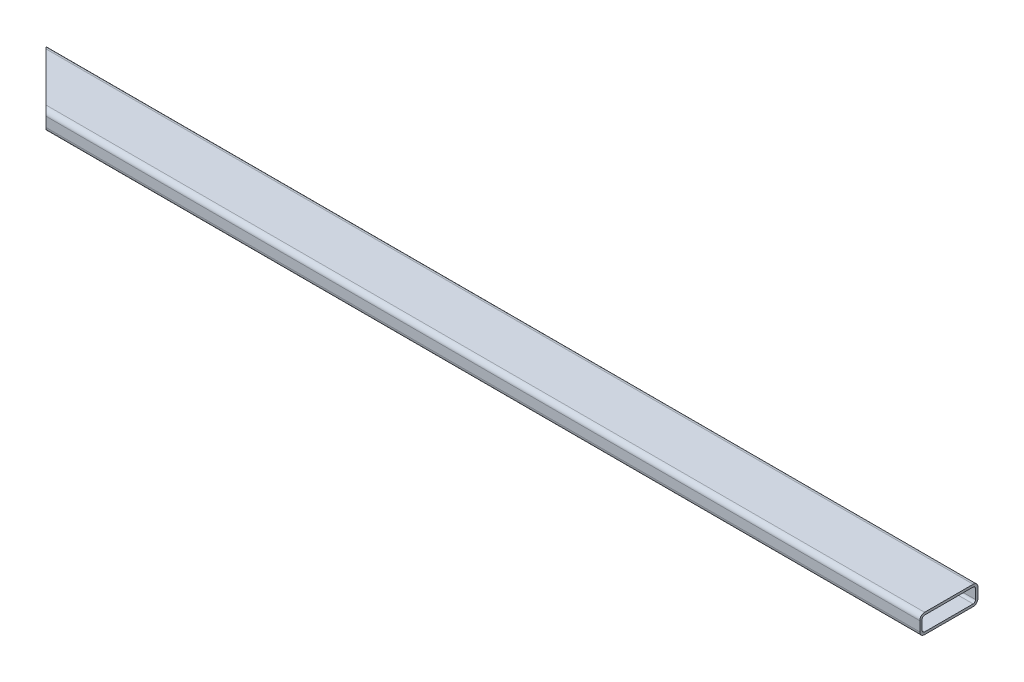
ISO-10303-21;
HEADER;
FILE_DESCRIPTION(('STEP AP214'),'2;1');
FILE_NAME('part.step','',(''),(''),'','','');
FILE_SCHEMA(('AUTOMOTIVE_DESIGN { 1 0 10303 214 1 1 1 1 }'));
ENDSEC;
DATA;
#1=APPLICATION_CONTEXT('core data for automotive mechanical design processes');
#2=APPLICATION_PROTOCOL_DEFINITION('international standard','automotive_design',2000,#1);
#3=PRODUCT_CONTEXT('',#1,'mechanical');
#4=PRODUCT('Part','Part','',(#3));
#5=PRODUCT_RELATED_PRODUCT_CATEGORY('part','',(#4));
#6=PRODUCT_DEFINITION_FORMATION('','',#4);
#7=PRODUCT_DEFINITION_CONTEXT('part definition',#1,'design');
#8=PRODUCT_DEFINITION('design','',#6,#7);
#9=PRODUCT_DEFINITION_SHAPE('','',#8);
#10=(LENGTH_UNIT() NAMED_UNIT(*) SI_UNIT(.MILLI.,.METRE.));
#11=(NAMED_UNIT(*) PLANE_ANGLE_UNIT() SI_UNIT($,.RADIAN.));
#12=(NAMED_UNIT(*) SI_UNIT($,.STERADIAN.) SOLID_ANGLE_UNIT());
#13=UNCERTAINTY_MEASURE_WITH_UNIT(LENGTH_MEASURE(1.E-05),#10,'distance_accuracy_value','');
#14=(GEOMETRIC_REPRESENTATION_CONTEXT(3) GLOBAL_UNCERTAINTY_ASSIGNED_CONTEXT((#13)) GLOBAL_UNIT_ASSIGNED_CONTEXT((#10,
#11,#12)) REPRESENTATION_CONTEXT('',''));
#15=CARTESIAN_POINT('',(0.,0.,0.));
#16=DIRECTION('',(0.,0.,1.));
#17=DIRECTION('',(1.,0.,0.));
#18=AXIS2_PLACEMENT_3D('',#15,#16,#17);
#19=CARTESIAN_POINT('',(1219.2,0.,0.));
#20=DIRECTION('',(0.,0.,-1.));
#21=DIRECTION('',(-1.,0.,0.));
#22=AXIS2_PLACEMENT_3D('',#19,#20,#21);
#23=PLANE('',#22);
#24=DIRECTION('',(-1.,0.,0.));
#25=VECTOR('',#24,1.);
#26=CARTESIAN_POINT('',(1219.2,19.05,0.));
#27=LINE('',#26,#25);
#28=CARTESIAN_POINT('',(1219.2,19.05,0.));
#29=VERTEX_POINT('',#28);
#30=CARTESIAN_POINT('',(76.1999999999998,19.05,0.));
#31=VERTEX_POINT('',#30);
#32=EDGE_CURVE('E171',#29,#31,#27,.T.);
#33=ORIENTED_EDGE('',*,*,#32,.T.);
#34=DIRECTION('',(0.,1.,0.));
#35=VECTOR('',#34,1.);
#36=CARTESIAN_POINT('',(76.1999999999998,0.,0.));
#37=LINE('',#36,#35);
#38=CARTESIAN_POINT('',(76.1999999999998,6.35,0.));
#39=VERTEX_POINT('',#38);
#40=EDGE_CURVE('E51',#39,#31,#37,.T.);
#41=ORIENTED_EDGE('',*,*,#40,.F.);
#42=DIRECTION('',(-1.,0.,0.));
#43=VECTOR('',#42,1.);
#44=CARTESIAN_POINT('',(1219.2,6.35,0.));
#45=LINE('',#44,#43);
#46=CARTESIAN_POINT('',(1219.2,6.35,0.));
#47=VERTEX_POINT('',#46);
#48=EDGE_CURVE('E44',#39,#47,#45,.F.);
#49=ORIENTED_EDGE('',*,*,#48,.T.);
#50=DIRECTION('',(0.,-1.,0.));
#51=VECTOR('',#50,1.);
#52=CARTESIAN_POINT('',(1219.2,0.,0.));
#53=LINE('',#52,#51);
#54=EDGE_CURVE('E181',#29,#47,#53,.T.);
#55=ORIENTED_EDGE('',*,*,#54,.F.);
#56=EDGE_LOOP('',(#33,#41,#49,#55));
#57=FACE_BOUND('',#56,.T.);
#58=ADVANCED_FACE('F36',(#57),#23,.F.);
#59=CARTESIAN_POINT('',(1219.2,0.,0.));
#60=DIRECTION('',(0.,1.,0.));
#61=DIRECTION('',(0.,0.,1.));
#62=AXIS2_PLACEMENT_3D('',#59,#60,#61);
#63=PLANE('',#62);
#64=DIRECTION('',(-1.,0.,0.));
#65=VECTOR('',#64,1.);
#66=CARTESIAN_POINT('',(1219.2,0.,-6.35));
#67=LINE('',#66,#65);
#68=CARTESIAN_POINT('',(1219.2,0.,-6.35));
#69=VERTEX_POINT('',#68);
#70=CARTESIAN_POINT('',(69.8499999999999,0.,-6.34999999999998));
#71=VERTEX_POINT('',#70);
#72=EDGE_CURVE('E196',#69,#71,#67,.T.);
#73=ORIENTED_EDGE('',*,*,#72,.T.);
#74=DIRECTION('',(-0.707106781186547,0.,-0.707106781186548));
#75=VECTOR('',#74,1.);
#76=CARTESIAN_POINT('',(0.,0.,-76.2));
#77=LINE('',#76,#75);
#78=CARTESIAN_POINT('',(6.35000000000005,0.,-69.85));
#79=VERTEX_POINT('',#78);
#80=EDGE_CURVE('E165',#71,#79,#77,.T.);
#81=ORIENTED_EDGE('',*,*,#80,.T.);
#82=DIRECTION('',(-1.,0.,0.));
#83=VECTOR('',#82,1.);
#84=CARTESIAN_POINT('',(1219.2,0.,-69.85));
#85=LINE('',#84,#83);
#86=CARTESIAN_POINT('',(1219.2,0.,-69.85));
#87=VERTEX_POINT('',#86);
#88=EDGE_CURVE('E198',#79,#87,#85,.F.);
#89=ORIENTED_EDGE('',*,*,#88,.T.);
#90=DIRECTION('',(0.,0.,-1.));
#91=VECTOR('',#90,1.);
#92=CARTESIAN_POINT('',(1219.2,0.,0.));
#93=LINE('',#92,#91);
#94=EDGE_CURVE('E190',#69,#87,#93,.T.);
#95=ORIENTED_EDGE('',*,*,#94,.F.);
#96=EDGE_LOOP('',(#73,#81,#89,#95));
#97=FACE_BOUND('',#96,.T.);
#98=ADVANCED_FACE('F280',(#97),#63,.F.);
#99=CARTESIAN_POINT('',(1219.2,0.,-76.2));
#100=DIRECTION('',(0.,0.,1.));
#101=DIRECTION('',(1.,0.,0.));
#102=AXIS2_PLACEMENT_3D('',#99,#100,#101);
#103=PLANE('',#102);
#104=DIRECTION('',(0.,1.,0.));
#105=VECTOR('',#104,1.);
#106=CARTESIAN_POINT('',(1219.2,0.,-76.2));
#107=LINE('',#106,#105);
#108=CARTESIAN_POINT('',(1219.2,6.35,-76.2));
#109=VERTEX_POINT('',#108);
#110=CARTESIAN_POINT('',(1219.2,19.05,-76.2));
#111=VERTEX_POINT('',#110);
#112=EDGE_CURVE('E213',#109,#111,#107,.T.);
#113=ORIENTED_EDGE('',*,*,#112,.F.);
#114=DIRECTION('',(-1.,0.,0.));
#115=VECTOR('',#114,1.);
#116=CARTESIAN_POINT('',(1219.2,6.35,-76.2));
#117=LINE('',#116,#115);
#118=CARTESIAN_POINT('',(0.,6.35,-76.2));
#119=VERTEX_POINT('',#118);
#120=EDGE_CURVE('E203',#109,#119,#117,.T.);
#121=ORIENTED_EDGE('',*,*,#120,.T.);
#122=DIRECTION('',(0.,1.,0.));
#123=VECTOR('',#122,1.);
#124=CARTESIAN_POINT('',(0.,0.,-76.2));
#125=LINE('',#124,#123);
#126=CARTESIAN_POINT('',(0.,19.05,-76.2));
#127=VERTEX_POINT('',#126);
#128=EDGE_CURVE('E191',#119,#127,#125,.T.);
#129=ORIENTED_EDGE('',*,*,#128,.T.);
#130=DIRECTION('',(-1.,0.,0.));
#131=VECTOR('',#130,1.);
#132=CARTESIAN_POINT('',(1219.2,19.05,-76.2));
#133=LINE('',#132,#131);
#134=EDGE_CURVE('E206',#127,#111,#133,.F.);
#135=ORIENTED_EDGE('',*,*,#134,.T.);
#136=EDGE_LOOP('',(#113,#121,#129,#135));
#137=FACE_BOUND('',#136,.T.);
#138=ADVANCED_FACE('F289',(#137),#103,.F.);
#139=CARTESIAN_POINT('',(1219.2,25.4,0.));
#140=DIRECTION('',(0.,-1.,0.));
#141=DIRECTION('',(0.,0.,-1.));
#142=AXIS2_PLACEMENT_3D('',#139,#140,#141);
#143=PLANE('',#142);
#144=DIRECTION('',(-1.,0.,0.));
#145=VECTOR('',#144,1.);
#146=CARTESIAN_POINT('',(1219.2,25.4,-69.85));
#147=LINE('',#146,#145);
#148=CARTESIAN_POINT('',(1219.2,25.4,-69.85));
#149=VERTEX_POINT('',#148);
#150=CARTESIAN_POINT('',(6.35000000000005,25.4,-69.85));
#151=VERTEX_POINT('',#150);
#152=EDGE_CURVE('E164',#149,#151,#147,.T.);
#153=ORIENTED_EDGE('',*,*,#152,.T.);
#154=DIRECTION('',(-0.707106781186547,0.,-0.707106781186548));
#155=VECTOR('',#154,1.);
#156=CARTESIAN_POINT('',(0.,25.4,-76.2));
#157=LINE('',#156,#155);
#158=CARTESIAN_POINT('',(69.8499999999999,25.4,-6.34999999999998));
#159=VERTEX_POINT('',#158);
#160=EDGE_CURVE('E148',#159,#151,#157,.T.);
#161=ORIENTED_EDGE('',*,*,#160,.F.);
#162=DIRECTION('',(-1.,0.,0.));
#163=VECTOR('',#162,1.);
#164=CARTESIAN_POINT('',(1219.2,25.4,-6.35));
#165=LINE('',#164,#163);
#166=CARTESIAN_POINT('',(1219.2,25.4,-6.35));
#167=VERTEX_POINT('',#166);
#168=EDGE_CURVE('E161',#159,#167,#165,.F.);
#169=ORIENTED_EDGE('',*,*,#168,.T.);
#170=DIRECTION('',(0.,0.,1.));
#171=VECTOR('',#170,1.);
#172=CARTESIAN_POINT('',(1219.2,25.4,0.));
#173=LINE('',#172,#171);
#174=EDGE_CURVE('E208',#149,#167,#173,.T.);
#175=ORIENTED_EDGE('',*,*,#174,.F.);
#176=EDGE_LOOP('',(#153,#161,#169,#175));
#177=FACE_BOUND('',#176,.T.);
#178=ADVANCED_FACE('F159',(#177),#143,.F.);
#179=CARTESIAN_POINT('',(1219.2,0.,0.));
#180=DIRECTION('',(-1.,0.,0.));
#181=DIRECTION('',(0.,0.,1.));
#182=AXIS2_PLACEMENT_3D('',#179,#180,#181);
#183=PLANE('',#182);
#184=DIRECTION('',(0.,0.,-1.));
#185=VECTOR('',#184,1.);
#186=CARTESIAN_POINT('',(1219.2,3.175,0.));
#187=LINE('',#186,#185);
#188=CARTESIAN_POINT('',(1219.2,3.175,-6.35));
#189=VERTEX_POINT('',#188);
#190=CARTESIAN_POINT('',(1219.2,3.175,-69.85));
#191=VERTEX_POINT('',#190);
#192=EDGE_CURVE('E231',#189,#191,#187,.T.);
#193=ORIENTED_EDGE('',*,*,#192,.F.);
#194=CARTESIAN_POINT('',(1219.2,6.35,-6.35));
#195=DIRECTION('',(-1.,0.,0.));
#196=DIRECTION('',(0.,0.,1.));
#197=AXIS2_PLACEMENT_3D('',#194,#195,#196);
#198=CIRCLE('',#197,3.175);
#199=CARTESIAN_POINT('',(1219.2,6.35,-3.175));
#200=VERTEX_POINT('',#199);
#201=EDGE_CURVE('E219',#200,#189,#198,.F.);
#202=ORIENTED_EDGE('',*,*,#201,.F.);
#203=DIRECTION('',(0.,-1.,0.));
#204=VECTOR('',#203,1.);
#205=CARTESIAN_POINT('',(1219.2,0.,-3.175));
#206=LINE('',#205,#204);
#207=CARTESIAN_POINT('',(1219.2,19.05,-3.175));
#208=VERTEX_POINT('',#207);
#209=EDGE_CURVE('E236',#208,#200,#206,.T.);
#210=ORIENTED_EDGE('',*,*,#209,.F.);
#211=CARTESIAN_POINT('',(1219.2,19.05,-6.35));
#212=DIRECTION('',(-1.,0.,0.));
#213=DIRECTION('',(0.,0.,1.));
#214=AXIS2_PLACEMENT_3D('',#211,#212,#213);
#215=CIRCLE('',#214,3.175);
#216=CARTESIAN_POINT('',(1219.2,22.225,-6.35));
#217=VERTEX_POINT('',#216);
#218=EDGE_CURVE('E217',#217,#208,#215,.F.);
#219=ORIENTED_EDGE('',*,*,#218,.F.);
#220=DIRECTION('',(0.,0.,1.));
#221=VECTOR('',#220,1.);
#222=CARTESIAN_POINT('',(1219.2,22.225,0.));
#223=LINE('',#222,#221);
#224=CARTESIAN_POINT('',(1219.2,22.225,-69.85));
#225=VERTEX_POINT('',#224);
#226=EDGE_CURVE('E221',#225,#217,#223,.T.);
#227=ORIENTED_EDGE('',*,*,#226,.F.);
#228=CARTESIAN_POINT('',(1219.2,19.05,-69.85));
#229=DIRECTION('',(-1.,0.,0.));
#230=DIRECTION('',(0.,0.,1.));
#231=AXIS2_PLACEMENT_3D('',#228,#229,#230);
#232=CIRCLE('',#231,3.175);
#233=CARTESIAN_POINT('',(1219.2,19.05,-73.025));
#234=VERTEX_POINT('',#233);
#235=EDGE_CURVE('E226',#234,#225,#232,.F.);
#236=ORIENTED_EDGE('',*,*,#235,.F.);
#237=DIRECTION('',(0.,1.,0.));
#238=VECTOR('',#237,1.);
#239=CARTESIAN_POINT('',(1219.2,0.,-73.025));
#240=LINE('',#239,#238);
#241=CARTESIAN_POINT('',(1219.2,6.35,-73.025));
#242=VERTEX_POINT('',#241);
#243=EDGE_CURVE('E225',#242,#234,#240,.T.);
#244=ORIENTED_EDGE('',*,*,#243,.F.);
#245=CARTESIAN_POINT('',(1219.2,6.35,-69.85));
#246=DIRECTION('',(-1.,0.,0.));
#247=DIRECTION('',(0.,0.,1.));
#248=AXIS2_PLACEMENT_3D('',#245,#246,#247);
#249=CIRCLE('',#248,3.175);
#250=EDGE_CURVE('E228',#191,#242,#249,.F.);
#251=ORIENTED_EDGE('',*,*,#250,.F.);
#252=EDGE_LOOP('',(#193,#202,#210,#219,#227,#236,#244,#251));
#253=FACE_BOUND('',#252,.T.);
#254=ORIENTED_EDGE('',*,*,#94,.T.);
#255=CARTESIAN_POINT('',(1219.2,6.35,-69.85));
#256=DIRECTION('',(-1.,0.,0.));
#257=DIRECTION('',(0.,0.,1.));
#258=AXIS2_PLACEMENT_3D('',#255,#256,#257);
#259=CIRCLE('',#258,6.35);
#260=EDGE_CURVE('E169',#87,#109,#259,.F.);
#261=ORIENTED_EDGE('',*,*,#260,.T.);
#262=ORIENTED_EDGE('',*,*,#112,.T.);
#263=CARTESIAN_POINT('',(1219.2,19.05,-69.85));
#264=DIRECTION('',(-1.,0.,0.));
#265=DIRECTION('',(0.,0.,1.));
#266=AXIS2_PLACEMENT_3D('',#263,#264,#265);
#267=CIRCLE('',#266,6.35);
#268=EDGE_CURVE('E173',#111,#149,#267,.F.);
#269=ORIENTED_EDGE('',*,*,#268,.T.);
#270=ORIENTED_EDGE('',*,*,#174,.T.);
#271=CARTESIAN_POINT('',(1219.2,19.05,-6.35));
#272=DIRECTION('',(-1.,0.,0.));
#273=DIRECTION('',(0.,0.,1.));
#274=AXIS2_PLACEMENT_3D('',#271,#272,#273);
#275=CIRCLE('',#274,6.35);
#276=EDGE_CURVE('E168',#167,#29,#275,.F.);
#277=ORIENTED_EDGE('',*,*,#276,.T.);
#278=ORIENTED_EDGE('',*,*,#54,.T.);
#279=CARTESIAN_POINT('',(1219.2,6.35,-6.35));
#280=DIRECTION('',(-1.,0.,0.));
#281=DIRECTION('',(0.,0.,1.));
#282=AXIS2_PLACEMENT_3D('',#279,#280,#281);
#283=CIRCLE('',#282,6.35);
#284=EDGE_CURVE('E188',#47,#69,#283,.F.);
#285=ORIENTED_EDGE('',*,*,#284,.T.);
#286=EDGE_LOOP('',(#254,#261,#262,#269,#270,#277,#278,#285));
#287=FACE_BOUND('',#286,.T.);
#288=ADVANCED_FACE('F187',(#253,#287),#183,.F.);
#289=CARTESIAN_POINT('',(1219.2,6.35,-69.85));
#290=DIRECTION('',(-1.,0.,0.));
#291=DIRECTION('',(0.,0.,1.));
#292=AXIS2_PLACEMENT_3D('',#289,#290,#291);
#293=CYLINDRICAL_SURFACE('',#292,6.35);
#294=CARTESIAN_POINT('',(6.35000000000008,6.35,-69.85));
#295=DIRECTION('',(0.707106781186548,0.,-0.707106781186547));
#296=DIRECTION('',(-0.707106781186547,0.,-0.707106781186548));
#297=AXIS2_PLACEMENT_3D('',#294,#295,#296);
#298=ELLIPSE('',#297,8.98025612106914,6.35);
#299=EDGE_CURVE('E240',#119,#79,#298,.F.);
#300=ORIENTED_EDGE('',*,*,#299,.F.);
#301=ORIENTED_EDGE('',*,*,#120,.F.);
#302=ORIENTED_EDGE('',*,*,#260,.F.);
#303=ORIENTED_EDGE('',*,*,#88,.F.);
#304=EDGE_LOOP('',(#300,#301,#302,#303));
#305=FACE_BOUND('',#304,.T.);
#306=ADVANCED_FACE('F284',(#305),#293,.T.);
#307=CARTESIAN_POINT('',(1219.2,19.05,-69.85));
#308=DIRECTION('',(-1.,0.,0.));
#309=DIRECTION('',(0.,0.,1.));
#310=AXIS2_PLACEMENT_3D('',#307,#308,#309);
#311=CYLINDRICAL_SURFACE('',#310,6.35);
#312=CARTESIAN_POINT('',(6.35000000000008,19.05,-69.85));
#313=DIRECTION('',(0.707106781186548,0.,-0.707106781186547));
#314=DIRECTION('',(-0.707106781186547,0.,-0.707106781186548));
#315=AXIS2_PLACEMENT_3D('',#312,#313,#314);
#316=ELLIPSE('',#315,8.98025612106914,6.35);
#317=EDGE_CURVE('E258',#151,#127,#316,.F.);
#318=ORIENTED_EDGE('',*,*,#317,.F.);
#319=ORIENTED_EDGE('',*,*,#152,.F.);
#320=ORIENTED_EDGE('',*,*,#268,.F.);
#321=ORIENTED_EDGE('',*,*,#134,.F.);
#322=EDGE_LOOP('',(#318,#319,#320,#321));
#323=FACE_BOUND('',#322,.T.);
#324=ADVANCED_FACE('F292',(#323),#311,.T.);
#325=CARTESIAN_POINT('',(1219.2,6.35,-6.35));
#326=DIRECTION('',(-1.,0.,0.));
#327=DIRECTION('',(0.,0.,1.));
#328=AXIS2_PLACEMENT_3D('',#325,#326,#327);
#329=CYLINDRICAL_SURFACE('',#328,6.35);
#330=CARTESIAN_POINT('',(69.85,6.35,-6.35));
#331=DIRECTION('',(0.707106781186548,0.,-0.707106781186547));
#332=DIRECTION('',(-0.707106781186547,0.,-0.707106781186548));
#333=AXIS2_PLACEMENT_3D('',#330,#331,#332);
#334=ELLIPSE('',#333,8.98025612106914,6.35);
#335=EDGE_CURVE('E154',#71,#39,#334,.F.);
#336=ORIENTED_EDGE('',*,*,#335,.F.);
#337=ORIENTED_EDGE('',*,*,#72,.F.);
#338=ORIENTED_EDGE('',*,*,#284,.F.);
#339=ORIENTED_EDGE('',*,*,#48,.F.);
#340=EDGE_LOOP('',(#336,#337,#338,#339));
#341=FACE_BOUND('',#340,.T.);
#342=ADVANCED_FACE('F194',(#341),#329,.T.);
#343=CARTESIAN_POINT('',(1219.2,19.05,-6.35));
#344=DIRECTION('',(-1.,0.,0.));
#345=DIRECTION('',(0.,0.,1.));
#346=AXIS2_PLACEMENT_3D('',#343,#344,#345);
#347=CYLINDRICAL_SURFACE('',#346,6.35);
#348=CARTESIAN_POINT('',(69.85,19.05,-6.35));
#349=DIRECTION('',(0.707106781186548,0.,-0.707106781186547));
#350=DIRECTION('',(-0.707106781186547,0.,-0.707106781186548));
#351=AXIS2_PLACEMENT_3D('',#348,#349,#350);
#352=ELLIPSE('',#351,8.98025612106914,6.35);
#353=EDGE_CURVE('E145',#31,#159,#352,.F.);
#354=ORIENTED_EDGE('',*,*,#353,.F.);
#355=ORIENTED_EDGE('',*,*,#32,.F.);
#356=ORIENTED_EDGE('',*,*,#276,.F.);
#357=ORIENTED_EDGE('',*,*,#168,.F.);
#358=EDGE_LOOP('',(#354,#355,#356,#357));
#359=FACE_BOUND('',#358,.T.);
#360=ADVANCED_FACE('F38',(#359),#347,.T.);
#361=CARTESIAN_POINT('',(1219.2,0.,-3.175));
#362=DIRECTION('',(0.,0.,-1.));
#363=DIRECTION('',(-1.,0.,0.));
#364=AXIS2_PLACEMENT_3D('',#361,#362,#363);
#365=PLANE('',#364);
#366=DIRECTION('',(0.,-1.,0.));
#367=VECTOR('',#366,1.);
#368=CARTESIAN_POINT('',(73.0249999999999,0.,-3.175));
#369=LINE('',#368,#367);
#370=CARTESIAN_POINT('',(73.0249999999999,19.05,-3.175));
#371=VERTEX_POINT('',#370);
#372=CARTESIAN_POINT('',(73.0249999999999,6.35,-3.175));
#373=VERTEX_POINT('',#372);
#374=EDGE_CURVE('E273',#371,#373,#369,.T.);
#375=ORIENTED_EDGE('',*,*,#374,.F.);
#376=DIRECTION('',(-1.,0.,0.));
#377=VECTOR('',#376,1.);
#378=CARTESIAN_POINT('',(1219.2,19.05,-3.175));
#379=LINE('',#378,#377);
#380=EDGE_CURVE('E245',#208,#371,#379,.T.);
#381=ORIENTED_EDGE('',*,*,#380,.F.);
#382=ORIENTED_EDGE('',*,*,#209,.T.);
#383=DIRECTION('',(-1.,0.,0.));
#384=VECTOR('',#383,1.);
#385=CARTESIAN_POINT('',(1219.2,6.35,-3.175));
#386=LINE('',#385,#384);
#387=EDGE_CURVE('E211',#373,#200,#386,.F.);
#388=ORIENTED_EDGE('',*,*,#387,.F.);
#389=EDGE_LOOP('',(#375,#381,#382,#388));
#390=FACE_BOUND('',#389,.T.);
#391=ADVANCED_FACE('F341',(#390),#365,.T.);
#392=CARTESIAN_POINT('',(1219.2,3.175,0.));
#393=DIRECTION('',(0.,1.,0.));
#394=DIRECTION('',(0.,0.,1.));
#395=AXIS2_PLACEMENT_3D('',#392,#393,#394);
#396=PLANE('',#395);
#397=DIRECTION('',(-0.707106781186547,0.,-0.707106781186548));
#398=VECTOR('',#397,1.);
#399=CARTESIAN_POINT('',(647.699999999998,3.175,571.5));
#400=LINE('',#399,#398);
#401=CARTESIAN_POINT('',(69.85,3.175,-6.35));
#402=VERTEX_POINT('',#401);
#403=CARTESIAN_POINT('',(6.34999999999974,3.175,-69.85));
#404=VERTEX_POINT('',#403);
#405=EDGE_CURVE('E263',#402,#404,#400,.T.);
#406=ORIENTED_EDGE('',*,*,#405,.F.);
#407=DIRECTION('',(1.,0.,0.));
#408=VECTOR('',#407,1.);
#409=CARTESIAN_POINT('',(1219.2,3.175,-6.35));
#410=LINE('',#409,#408);
#411=EDGE_CURVE('E250',#189,#402,#410,.F.);
#412=ORIENTED_EDGE('',*,*,#411,.F.);
#413=ORIENTED_EDGE('',*,*,#192,.T.);
#414=DIRECTION('',(1.,0.,0.));
#415=VECTOR('',#414,1.);
#416=CARTESIAN_POINT('',(1219.2,3.175,-69.85));
#417=LINE('',#416,#415);
#418=EDGE_CURVE('E220',#404,#191,#417,.T.);
#419=ORIENTED_EDGE('',*,*,#418,.F.);
#420=EDGE_LOOP('',(#406,#412,#413,#419));
#421=FACE_BOUND('',#420,.T.);
#422=ADVANCED_FACE('F337',(#421),#396,.T.);
#423=CARTESIAN_POINT('',(1219.2,0.,-73.025));
#424=DIRECTION('',(0.,0.,1.));
#425=DIRECTION('',(1.,0.,0.));
#426=AXIS2_PLACEMENT_3D('',#423,#424,#425);
#427=PLANE('',#426);
#428=DIRECTION('',(0.,1.,0.));
#429=VECTOR('',#428,1.);
#430=CARTESIAN_POINT('',(3.17499999999993,0.,-73.025));
#431=LINE('',#430,#429);
#432=CARTESIAN_POINT('',(3.17499999999993,6.35,-73.025));
#433=VERTEX_POINT('',#432);
#434=CARTESIAN_POINT('',(3.17500000000015,19.05,-73.025));
#435=VERTEX_POINT('',#434);
#436=EDGE_CURVE('E265',#433,#435,#431,.T.);
#437=ORIENTED_EDGE('',*,*,#436,.F.);
#438=DIRECTION('',(1.,0.,0.));
#439=VECTOR('',#438,1.);
#440=CARTESIAN_POINT('',(1219.2,6.35,-73.025));
#441=LINE('',#440,#439);
#442=EDGE_CURVE('E247',#242,#433,#441,.F.);
#443=ORIENTED_EDGE('',*,*,#442,.F.);
#444=ORIENTED_EDGE('',*,*,#243,.T.);
#445=DIRECTION('',(1.,0.,0.));
#446=VECTOR('',#445,1.);
#447=CARTESIAN_POINT('',(1219.2,19.05,-73.025));
#448=LINE('',#447,#446);
#449=EDGE_CURVE('E224',#435,#234,#448,.T.);
#450=ORIENTED_EDGE('',*,*,#449,.F.);
#451=EDGE_LOOP('',(#437,#443,#444,#450));
#452=FACE_BOUND('',#451,.T.);
#453=ADVANCED_FACE('F333',(#452),#427,.T.);
#454=CARTESIAN_POINT('',(1219.2,22.225,0.));
#455=DIRECTION('',(0.,-1.,0.));
#456=DIRECTION('',(0.,0.,-1.));
#457=AXIS2_PLACEMENT_3D('',#454,#455,#456);
#458=PLANE('',#457);
#459=DIRECTION('',(0.707106781186547,0.,0.707106781186548));
#460=VECTOR('',#459,1.);
#461=CARTESIAN_POINT('',(647.699999999998,22.225,571.5));
#462=LINE('',#461,#460);
#463=CARTESIAN_POINT('',(6.34999999999974,22.225,-69.85));
#464=VERTEX_POINT('',#463);
#465=CARTESIAN_POINT('',(69.85,22.225,-6.35));
#466=VERTEX_POINT('',#465);
#467=EDGE_CURVE('E59',#464,#466,#462,.T.);
#468=ORIENTED_EDGE('',*,*,#467,.F.);
#469=DIRECTION('',(1.,0.,0.));
#470=VECTOR('',#469,1.);
#471=CARTESIAN_POINT('',(1219.2,22.225,-69.85));
#472=LINE('',#471,#470);
#473=EDGE_CURVE('E242',#225,#464,#472,.F.);
#474=ORIENTED_EDGE('',*,*,#473,.F.);
#475=ORIENTED_EDGE('',*,*,#226,.T.);
#476=DIRECTION('',(1.,0.,0.));
#477=VECTOR('',#476,1.);
#478=CARTESIAN_POINT('',(1219.2,22.225,-6.35));
#479=LINE('',#478,#477);
#480=EDGE_CURVE('E233',#466,#217,#479,.T.);
#481=ORIENTED_EDGE('',*,*,#480,.F.);
#482=EDGE_LOOP('',(#468,#474,#475,#481));
#483=FACE_BOUND('',#482,.T.);
#484=ADVANCED_FACE('F329',(#483),#458,.T.);
#485=CARTESIAN_POINT('',(1219.2,6.35,-69.85));
#486=DIRECTION('',(-1.,0.,0.));
#487=DIRECTION('',(0.,0.,1.));
#488=AXIS2_PLACEMENT_3D('',#485,#486,#487);
#489=CYLINDRICAL_SURFACE('',#488,3.175);
#490=ORIENTED_EDGE('',*,*,#442,.T.);
#491=CARTESIAN_POINT('',(6.35000000000008,6.35,-69.85));
#492=DIRECTION('',(0.707106781186548,0.,-0.707106781186547));
#493=DIRECTION('',(-0.707106781186547,0.,-0.707106781186548));
#494=AXIS2_PLACEMENT_3D('',#491,#492,#493);
#495=ELLIPSE('',#494,4.49012806053457,3.175);
#496=EDGE_CURVE('E155',#433,#404,#495,.F.);
#497=ORIENTED_EDGE('',*,*,#496,.T.);
#498=ORIENTED_EDGE('',*,*,#418,.T.);
#499=ORIENTED_EDGE('',*,*,#250,.T.);
#500=EDGE_LOOP('',(#490,#497,#498,#499));
#501=FACE_BOUND('',#500,.T.);
#502=ADVANCED_FACE('F325',(#501),#489,.F.);
#503=CARTESIAN_POINT('',(1219.2,19.05,-69.85));
#504=DIRECTION('',(-1.,0.,0.));
#505=DIRECTION('',(0.,0.,1.));
#506=AXIS2_PLACEMENT_3D('',#503,#504,#505);
#507=CYLINDRICAL_SURFACE('',#506,3.175);
#508=ORIENTED_EDGE('',*,*,#473,.T.);
#509=CARTESIAN_POINT('',(6.35000000000008,19.05,-69.85));
#510=DIRECTION('',(0.707106781186548,0.,-0.707106781186547));
#511=DIRECTION('',(-0.707106781186547,0.,-0.707106781186548));
#512=AXIS2_PLACEMENT_3D('',#509,#510,#511);
#513=ELLIPSE('',#512,4.49012806053457,3.175);
#514=EDGE_CURVE('E267',#464,#435,#513,.F.);
#515=ORIENTED_EDGE('',*,*,#514,.T.);
#516=ORIENTED_EDGE('',*,*,#449,.T.);
#517=ORIENTED_EDGE('',*,*,#235,.T.);
#518=EDGE_LOOP('',(#508,#515,#516,#517));
#519=FACE_BOUND('',#518,.T.);
#520=ADVANCED_FACE('F321',(#519),#507,.F.);
#521=CARTESIAN_POINT('',(1219.2,6.35,-6.35));
#522=DIRECTION('',(-1.,0.,0.));
#523=DIRECTION('',(0.,0.,1.));
#524=AXIS2_PLACEMENT_3D('',#521,#522,#523);
#525=CYLINDRICAL_SURFACE('',#524,3.175);
#526=ORIENTED_EDGE('',*,*,#411,.T.);
#527=CARTESIAN_POINT('',(69.85,6.35,-6.35));
#528=DIRECTION('',(0.707106781186548,0.,-0.707106781186547));
#529=DIRECTION('',(-0.707106781186547,0.,-0.707106781186548));
#530=AXIS2_PLACEMENT_3D('',#527,#528,#529);
#531=ELLIPSE('',#530,4.49012806053457,3.175);
#532=EDGE_CURVE('E270',#402,#373,#531,.F.);
#533=ORIENTED_EDGE('',*,*,#532,.T.);
#534=ORIENTED_EDGE('',*,*,#387,.T.);
#535=ORIENTED_EDGE('',*,*,#201,.T.);
#536=EDGE_LOOP('',(#526,#533,#534,#535));
#537=FACE_BOUND('',#536,.T.);
#538=ADVANCED_FACE('F317',(#537),#525,.F.);
#539=CARTESIAN_POINT('',(1219.2,19.05,-6.35));
#540=DIRECTION('',(-1.,0.,0.));
#541=DIRECTION('',(0.,0.,1.));
#542=AXIS2_PLACEMENT_3D('',#539,#540,#541);
#543=CYLINDRICAL_SURFACE('',#542,3.175);
#544=ORIENTED_EDGE('',*,*,#380,.T.);
#545=CARTESIAN_POINT('',(69.85,19.05,-6.35));
#546=DIRECTION('',(0.707106781186548,0.,-0.707106781186547));
#547=DIRECTION('',(-0.707106781186547,0.,-0.707106781186548));
#548=AXIS2_PLACEMENT_3D('',#545,#546,#547);
#549=ELLIPSE('',#548,4.49012806053457,3.175);
#550=EDGE_CURVE('E11',#371,#466,#549,.F.);
#551=ORIENTED_EDGE('',*,*,#550,.T.);
#552=ORIENTED_EDGE('',*,*,#480,.T.);
#553=ORIENTED_EDGE('',*,*,#218,.T.);
#554=EDGE_LOOP('',(#544,#551,#552,#553));
#555=FACE_BOUND('',#554,.T.);
#556=ADVANCED_FACE('F314',(#555),#543,.F.);
#557=CARTESIAN_POINT('',(0.,0.,-76.2));
#558=DIRECTION('',(0.707106781186548,0.,-0.707106781186547));
#559=DIRECTION('',(-0.707106781186547,0.,-0.707106781186548));
#560=AXIS2_PLACEMENT_3D('',#557,#558,#559);
#561=PLANE('',#560);
#562=ORIENTED_EDGE('',*,*,#299,.T.);
#563=ORIENTED_EDGE('',*,*,#80,.F.);
#564=ORIENTED_EDGE('',*,*,#335,.T.);
#565=ORIENTED_EDGE('',*,*,#40,.T.);
#566=ORIENTED_EDGE('',*,*,#353,.T.);
#567=ORIENTED_EDGE('',*,*,#160,.T.);
#568=ORIENTED_EDGE('',*,*,#317,.T.);
#569=ORIENTED_EDGE('',*,*,#128,.F.);
#570=EDGE_LOOP('',(#562,#563,#564,#565,#566,#567,#568,#569));
#571=FACE_BOUND('',#570,.T.);
#572=ORIENTED_EDGE('',*,*,#436,.T.);
#573=ORIENTED_EDGE('',*,*,#514,.F.);
#574=ORIENTED_EDGE('',*,*,#467,.T.);
#575=ORIENTED_EDGE('',*,*,#550,.F.);
#576=ORIENTED_EDGE('',*,*,#374,.T.);
#577=ORIENTED_EDGE('',*,*,#532,.F.);
#578=ORIENTED_EDGE('',*,*,#405,.T.);
#579=ORIENTED_EDGE('',*,*,#496,.F.);
#580=EDGE_LOOP('',(#572,#573,#574,#575,#576,#577,#578,#579));
#581=FACE_BOUND('',#580,.T.);
#582=ADVANCED_FACE('F147',(#571,#581),#561,.F.);
#583=CLOSED_SHELL('',(#58,#98,#138,#178,#288,#306,#324,#342,#360,#391,#422,#453,#484,#502,#520,
#538,#556,#582));
#584=MANIFOLD_SOLID_BREP('B2',#583);
#585=ADVANCED_BREP_SHAPE_REPRESENTATION('',(#18,#584),#14);
#586=SHAPE_DEFINITION_REPRESENTATION(#9,#585);
ENDSEC;
END-ISO-10303-21;
